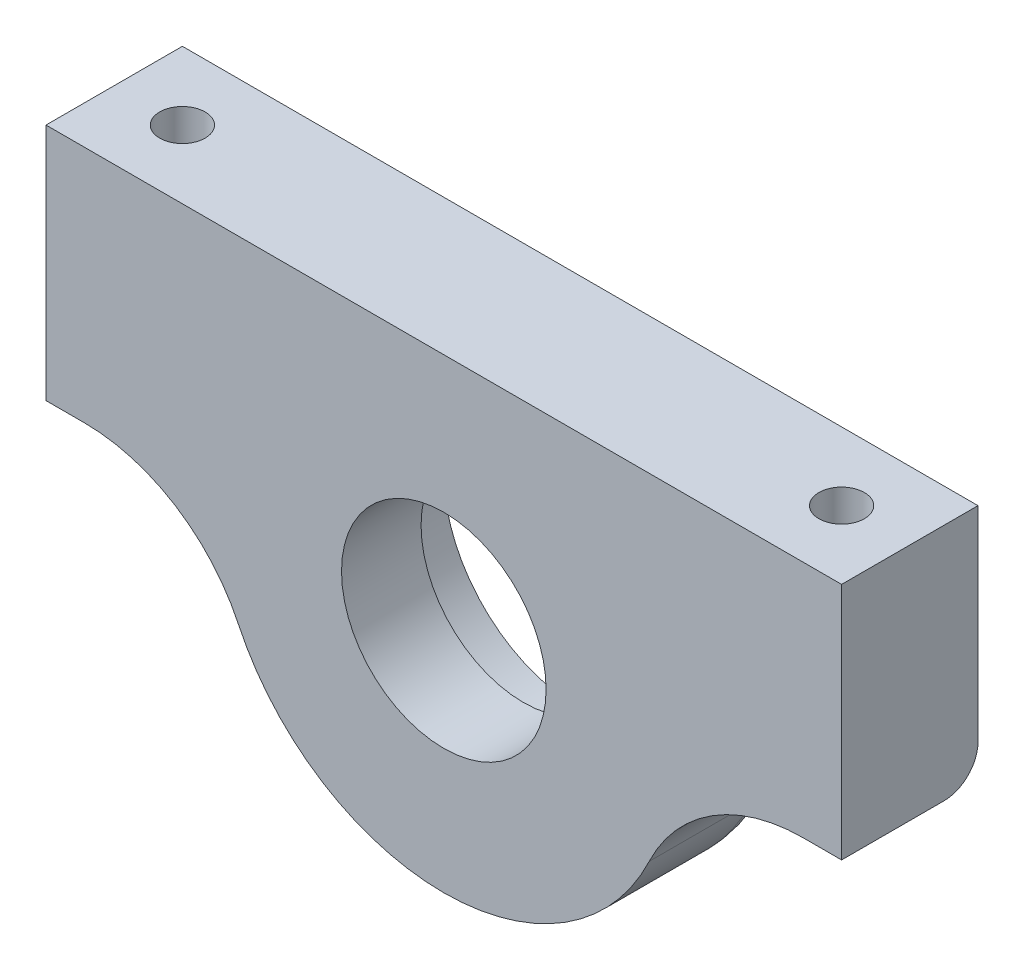
ISO-10303-21;
HEADER;
FILE_DESCRIPTION(('STEP AP214'),'2;1');
FILE_NAME('part.step','',(''),(''),'','','');
FILE_SCHEMA(('AUTOMOTIVE_DESIGN { 1 0 10303 214 1 1 1 1 }'));
ENDSEC;
DATA;
#1=APPLICATION_CONTEXT('core data for automotive mechanical design processes');
#2=APPLICATION_PROTOCOL_DEFINITION('international standard','automotive_design',2000,#1);
#3=PRODUCT_CONTEXT('',#1,'mechanical');
#4=PRODUCT('Part','Part','',(#3));
#5=PRODUCT_RELATED_PRODUCT_CATEGORY('part','',(#4));
#6=PRODUCT_DEFINITION_FORMATION('','',#4);
#7=PRODUCT_DEFINITION_CONTEXT('part definition',#1,'design');
#8=PRODUCT_DEFINITION('design','',#6,#7);
#9=PRODUCT_DEFINITION_SHAPE('','',#8);
#10=(LENGTH_UNIT() NAMED_UNIT(*) SI_UNIT(.MILLI.,.METRE.));
#11=(NAMED_UNIT(*) PLANE_ANGLE_UNIT() SI_UNIT($,.RADIAN.));
#12=(NAMED_UNIT(*) SI_UNIT($,.STERADIAN.) SOLID_ANGLE_UNIT());
#13=UNCERTAINTY_MEASURE_WITH_UNIT(LENGTH_MEASURE(1.E-05),#10,'distance_accuracy_value','');
#14=(GEOMETRIC_REPRESENTATION_CONTEXT(3) GLOBAL_UNCERTAINTY_ASSIGNED_CONTEXT((#13)) GLOBAL_UNIT_ASSIGNED_CONTEXT((#10,
#11,#12)) REPRESENTATION_CONTEXT('',''));
#15=CARTESIAN_POINT('',(0.,0.,0.));
#16=DIRECTION('',(0.,0.,1.));
#17=DIRECTION('',(1.,0.,0.));
#18=AXIS2_PLACEMENT_3D('',#15,#16,#17);
#19=CARTESIAN_POINT('',(0.,0.,6.));
#20=DIRECTION('',(0.,0.,-1.));
#21=DIRECTION('',(-1.,0.,0.));
#22=AXIS2_PLACEMENT_3D('',#19,#20,#21);
#23=CYLINDRICAL_SURFACE('',#22,9.);
#24=CARTESIAN_POINT('',(0.,0.,6.));
#25=DIRECTION('',(0.,0.,1.));
#26=DIRECTION('',(1.,0.,0.));
#27=AXIS2_PLACEMENT_3D('',#24,#25,#26);
#28=CIRCLE('',#27,9.);
#29=CARTESIAN_POINT('',(9.,0.,6.));
#30=VERTEX_POINT('',#29);
#31=EDGE_CURVE('E159',#30,#30,#28,.T.);
#32=ORIENTED_EDGE('',*,*,#31,.T.);
#33=EDGE_LOOP('',(#32));
#34=FACE_BOUND('',#33,.T.);
#35=CARTESIAN_POINT('',(0.,0.,-1.));
#36=DIRECTION('',(0.,0.,-1.));
#37=DIRECTION('',(-1.,0.,0.));
#38=AXIS2_PLACEMENT_3D('',#35,#36,#37);
#39=CIRCLE('',#38,9.);
#40=CARTESIAN_POINT('',(-9.,0.,-1.));
#41=VERTEX_POINT('',#40);
#42=EDGE_CURVE('E157',#41,#41,#39,.T.);
#43=ORIENTED_EDGE('',*,*,#42,.T.);
#44=EDGE_LOOP('',(#43));
#45=FACE_BOUND('',#44,.T.);
#46=ADVANCED_FACE('F36',(#34,#45),#23,.F.);
#47=CARTESIAN_POINT('',(-31.6227766016838,-15.,6.));
#48=DIRECTION('',(0.,0.,1.));
#49=DIRECTION('',(1.,0.,0.));
#50=AXIS2_PLACEMENT_3D('',#47,#48,#49);
#51=PLANE('',#50);
#52=DIRECTION('',(0.,-1.,0.));
#53=VECTOR('',#52,1.);
#54=CARTESIAN_POINT('',(-35.,21.,6.));
#55=LINE('',#54,#53);
#56=CARTESIAN_POINT('',(-35.,21.,6.));
#57=VERTEX_POINT('',#56);
#58=CARTESIAN_POINT('',(-35.,0.,6.));
#59=VERTEX_POINT('',#58);
#60=EDGE_CURVE('E133',#57,#59,#55,.T.);
#61=ORIENTED_EDGE('',*,*,#60,.T.);
#62=DIRECTION('',(1.,0.,0.));
#63=VECTOR('',#62,1.);
#64=CARTESIAN_POINT('',(-35.,0.,6.));
#65=LINE('',#64,#63);
#66=CARTESIAN_POINT('',(-31.6227766016838,0.,6.));
#67=VERTEX_POINT('',#66);
#68=EDGE_CURVE('E121',#59,#67,#65,.T.);
#69=ORIENTED_EDGE('',*,*,#68,.T.);
#70=CARTESIAN_POINT('',(-31.6227766016838,-15.,6.));
#71=DIRECTION('',(0.,0.,-1.));
#72=DIRECTION('',(1.,0.,0.));
#73=AXIS2_PLACEMENT_3D('',#70,#71,#72);
#74=CIRCLE('',#73,15.);
#75=CARTESIAN_POINT('',(-18.070158058105,-8.57142857142856,6.));
#76=VERTEX_POINT('',#75);
#77=EDGE_CURVE('E132',#67,#76,#74,.T.);
#78=ORIENTED_EDGE('',*,*,#77,.T.);
#79=CARTESIAN_POINT('',(0.,0.,6.));
#80=DIRECTION('',(0.,0.,1.));
#81=DIRECTION('',(1.,0.,0.));
#82=AXIS2_PLACEMENT_3D('',#79,#80,#81);
#83=CIRCLE('',#82,20.);
#84=CARTESIAN_POINT('',(18.070158058105,-8.57142857142857,6.));
#85=VERTEX_POINT('',#84);
#86=EDGE_CURVE('E213',#76,#85,#83,.T.);
#87=ORIENTED_EDGE('',*,*,#86,.T.);
#88=CARTESIAN_POINT('',(31.6227766016838,-15.,6.));
#89=DIRECTION('',(0.,0.,-1.));
#90=DIRECTION('',(-1.,0.,0.));
#91=AXIS2_PLACEMENT_3D('',#88,#89,#90);
#92=CIRCLE('',#91,15.);
#93=CARTESIAN_POINT('',(31.6227766016838,0.,6.));
#94=VERTEX_POINT('',#93);
#95=EDGE_CURVE('E215',#85,#94,#92,.T.);
#96=ORIENTED_EDGE('',*,*,#95,.T.);
#97=DIRECTION('',(1.,0.,0.));
#98=VECTOR('',#97,1.);
#99=CARTESIAN_POINT('',(31.6227766016838,0.,6.));
#100=LINE('',#99,#98);
#101=CARTESIAN_POINT('',(35.,0.,6.));
#102=VERTEX_POINT('',#101);
#103=EDGE_CURVE('E217',#94,#102,#100,.T.);
#104=ORIENTED_EDGE('',*,*,#103,.T.);
#105=DIRECTION('',(0.,1.,0.));
#106=VECTOR('',#105,1.);
#107=CARTESIAN_POINT('',(35.,0.,6.));
#108=LINE('',#107,#106);
#109=CARTESIAN_POINT('',(35.,21.,6.));
#110=VERTEX_POINT('',#109);
#111=EDGE_CURVE('E219',#102,#110,#108,.T.);
#112=ORIENTED_EDGE('',*,*,#111,.T.);
#113=DIRECTION('',(-1.,0.,0.));
#114=VECTOR('',#113,1.);
#115=CARTESIAN_POINT('',(-35.,21.,6.));
#116=LINE('',#115,#114);
#117=EDGE_CURVE('E139',#110,#57,#116,.T.);
#118=ORIENTED_EDGE('',*,*,#117,.T.);
#119=EDGE_LOOP('',(#61,#69,#78,#87,#96,#104,#112,#118));
#120=FACE_BOUND('',#119,.T.);
#121=ORIENTED_EDGE('',*,*,#31,.F.);
#122=EDGE_LOOP('',(#121));
#123=FACE_BOUND('',#122,.T.);
#124=ADVANCED_FACE('F136',(#120,#123),#51,.T.);
#125=CARTESIAN_POINT('',(-31.6227766016838,-15.,-6.));
#126=DIRECTION('',(0.,0.,1.));
#127=DIRECTION('',(1.,0.,0.));
#128=AXIS2_PLACEMENT_3D('',#125,#126,#127);
#129=PLANE('',#128);
#130=CARTESIAN_POINT('',(0.,0.,-6.));
#131=DIRECTION('',(0.,0.,-1.));
#132=DIRECTION('',(-1.,0.,0.));
#133=AXIS2_PLACEMENT_3D('',#130,#131,#132);
#134=CIRCLE('',#133,12.);
#135=CARTESIAN_POINT('',(-12.,0.,-6.));
#136=VERTEX_POINT('',#135);
#137=EDGE_CURVE('E205',#136,#136,#134,.T.);
#138=ORIENTED_EDGE('',*,*,#137,.F.);
#139=EDGE_LOOP('',(#138));
#140=FACE_BOUND('',#139,.T.);
#141=CARTESIAN_POINT('',(-31.6227766016838,-15.,-6.));
#142=DIRECTION('',(0.,0.,1.));
#143=DIRECTION('',(1.,0.,0.));
#144=AXIS2_PLACEMENT_3D('',#141,#142,#143);
#145=CIRCLE('',#144,18.);
#146=CARTESIAN_POINT('',(-15.3596343493893,-7.28571428571428,-6.));
#147=VERTEX_POINT('',#146);
#148=CARTESIAN_POINT('',(-31.6227766016838,3.,-6.));
#149=VERTEX_POINT('',#148);
#150=EDGE_CURVE('E167',#147,#149,#145,.T.);
#151=ORIENTED_EDGE('',*,*,#150,.T.);
#152=DIRECTION('',(1.,0.,0.));
#153=VECTOR('',#152,1.);
#154=CARTESIAN_POINT('',(-31.6227766016838,3.,-6.));
#155=LINE('',#154,#153);
#156=CARTESIAN_POINT('',(-35.,3.00000000000001,-6.));
#157=VERTEX_POINT('',#156);
#158=EDGE_CURVE('E169',#149,#157,#155,.F.);
#159=ORIENTED_EDGE('',*,*,#158,.T.);
#160=DIRECTION('',(0.,-1.,0.));
#161=VECTOR('',#160,1.);
#162=CARTESIAN_POINT('',(-35.,21.,-6.));
#163=LINE('',#162,#161);
#164=CARTESIAN_POINT('',(-35.,21.,-6.));
#165=VERTEX_POINT('',#164);
#166=EDGE_CURVE('E210',#165,#157,#163,.T.);
#167=ORIENTED_EDGE('',*,*,#166,.F.);
#168=DIRECTION('',(-1.,0.,0.));
#169=VECTOR('',#168,1.);
#170=CARTESIAN_POINT('',(-35.,21.,-6.));
#171=LINE('',#170,#169);
#172=CARTESIAN_POINT('',(35.,21.,-6.));
#173=VERTEX_POINT('',#172);
#174=EDGE_CURVE('E143',#173,#165,#171,.T.);
#175=ORIENTED_EDGE('',*,*,#174,.F.);
#176=DIRECTION('',(0.,1.,0.));
#177=VECTOR('',#176,1.);
#178=CARTESIAN_POINT('',(35.,0.,-6.));
#179=LINE('',#178,#177);
#180=CARTESIAN_POINT('',(35.,3.,-6.));
#181=VERTEX_POINT('',#180);
#182=EDGE_CURVE('E224',#181,#173,#179,.T.);
#183=ORIENTED_EDGE('',*,*,#182,.F.);
#184=DIRECTION('',(1.,0.,0.));
#185=VECTOR('',#184,1.);
#186=CARTESIAN_POINT('',(-31.6227766016838,3.,-6.));
#187=LINE('',#186,#185);
#188=CARTESIAN_POINT('',(31.6227766016838,3.,-6.));
#189=VERTEX_POINT('',#188);
#190=EDGE_CURVE('E165',#181,#189,#187,.F.);
#191=ORIENTED_EDGE('',*,*,#190,.T.);
#192=CARTESIAN_POINT('',(31.6227766016838,-15.,-6.));
#193=DIRECTION('',(0.,0.,1.));
#194=DIRECTION('',(1.,0.,0.));
#195=AXIS2_PLACEMENT_3D('',#192,#193,#194);
#196=CIRCLE('',#195,18.);
#197=CARTESIAN_POINT('',(15.3596343493893,-7.28571428571429,-6.));
#198=VERTEX_POINT('',#197);
#199=EDGE_CURVE('E163',#189,#198,#196,.T.);
#200=ORIENTED_EDGE('',*,*,#199,.T.);
#201=CARTESIAN_POINT('',(0.,0.,-6.));
#202=DIRECTION('',(0.,0.,1.));
#203=DIRECTION('',(1.,0.,0.));
#204=AXIS2_PLACEMENT_3D('',#201,#202,#203);
#205=CIRCLE('',#204,17.);
#206=EDGE_CURVE('E151',#198,#147,#205,.F.);
#207=ORIENTED_EDGE('',*,*,#206,.T.);
#208=EDGE_LOOP('',(#151,#159,#167,#175,#183,#191,#200,#207));
#209=FACE_BOUND('',#208,.T.);
#210=ADVANCED_FACE('F250',(#140,#209),#129,.F.);
#211=CARTESIAN_POINT('',(-35.,21.,6.));
#212=DIRECTION('',(1.,0.,0.));
#213=DIRECTION('',(0.,0.,-1.));
#214=AXIS2_PLACEMENT_3D('',#211,#212,#213);
#215=PLANE('',#214);
#216=ORIENTED_EDGE('',*,*,#166,.T.);
#217=CARTESIAN_POINT('',(-35.,3.,-3.));
#218=DIRECTION('',(1.,0.,0.));
#219=DIRECTION('',(0.,0.,-1.));
#220=AXIS2_PLACEMENT_3D('',#217,#218,#219);
#221=CIRCLE('',#220,3.);
#222=CARTESIAN_POINT('',(-35.,0.,-3.));
#223=VERTEX_POINT('',#222);
#224=EDGE_CURVE('E148',#157,#223,#221,.F.);
#225=ORIENTED_EDGE('',*,*,#224,.T.);
#226=DIRECTION('',(0.,0.,-1.));
#227=VECTOR('',#226,1.);
#228=CARTESIAN_POINT('',(-35.,0.,6.));
#229=LINE('',#228,#227);
#230=EDGE_CURVE('E126',#59,#223,#229,.T.);
#231=ORIENTED_EDGE('',*,*,#230,.F.);
#232=ORIENTED_EDGE('',*,*,#60,.F.);
#233=DIRECTION('',(0.,0.,-1.));
#234=VECTOR('',#233,1.);
#235=CARTESIAN_POINT('',(-35.,21.,6.));
#236=LINE('',#235,#234);
#237=EDGE_CURVE('E222',#57,#165,#236,.T.);
#238=ORIENTED_EDGE('',*,*,#237,.T.);
#239=EDGE_LOOP('',(#216,#225,#231,#232,#238));
#240=FACE_BOUND('',#239,.T.);
#241=ADVANCED_FACE('F146',(#240),#215,.F.);
#242=CARTESIAN_POINT('',(-35.,0.,6.));
#243=DIRECTION('',(0.,1.,0.));
#244=DIRECTION('',(0.,0.,1.));
#245=AXIS2_PLACEMENT_3D('',#242,#243,#244);
#246=PLANE('',#245);
#247=ORIENTED_EDGE('',*,*,#230,.T.);
#248=DIRECTION('',(1.,0.,0.));
#249=VECTOR('',#248,1.);
#250=CARTESIAN_POINT('',(-35.,0.,-3.));
#251=LINE('',#250,#249);
#252=CARTESIAN_POINT('',(-31.6227766016838,0.,-3.));
#253=VERTEX_POINT('',#252);
#254=EDGE_CURVE('E149',#223,#253,#251,.T.);
#255=ORIENTED_EDGE('',*,*,#254,.T.);
#256=DIRECTION('',(0.,0.,-1.));
#257=VECTOR('',#256,1.);
#258=CARTESIAN_POINT('',(-31.6227766016838,0.,6.));
#259=LINE('',#258,#257);
#260=EDGE_CURVE('E129',#67,#253,#259,.T.);
#261=ORIENTED_EDGE('',*,*,#260,.F.);
#262=ORIENTED_EDGE('',*,*,#68,.F.);
#263=EDGE_LOOP('',(#247,#255,#261,#262));
#264=FACE_BOUND('',#263,.T.);
#265=ADVANCED_FACE('F123',(#264),#246,.F.);
#266=CARTESIAN_POINT('',(-31.6227766016838,-15.,6.));
#267=DIRECTION('',(0.,0.,-1.));
#268=DIRECTION('',(-1.,0.,0.));
#269=AXIS2_PLACEMENT_3D('',#266,#267,#268);
#270=CYLINDRICAL_SURFACE('',#269,15.);
#271=ORIENTED_EDGE('',*,*,#260,.T.);
#272=CARTESIAN_POINT('',(-31.6227766016838,-15.,-3.));
#273=DIRECTION('',(0.,0.,1.));
#274=DIRECTION('',(1.,0.,0.));
#275=AXIS2_PLACEMENT_3D('',#272,#273,#274);
#276=CIRCLE('',#275,15.);
#277=CARTESIAN_POINT('',(-18.070158058105,-8.57142857142856,-3.));
#278=VERTEX_POINT('',#277);
#279=EDGE_CURVE('E172',#253,#278,#276,.F.);
#280=ORIENTED_EDGE('',*,*,#279,.T.);
#281=DIRECTION('',(0.,0.,-1.));
#282=VECTOR('',#281,1.);
#283=CARTESIAN_POINT('',(-18.070158058105,-8.57142857142856,6.));
#284=LINE('',#283,#282);
#285=EDGE_CURVE('E153',#76,#278,#284,.T.);
#286=ORIENTED_EDGE('',*,*,#285,.F.);
#287=ORIENTED_EDGE('',*,*,#77,.F.);
#288=EDGE_LOOP('',(#271,#280,#286,#287));
#289=FACE_BOUND('',#288,.T.);
#290=ADVANCED_FACE('F254',(#289),#270,.F.);
#291=CARTESIAN_POINT('',(0.,0.,6.));
#292=DIRECTION('',(0.,0.,-1.));
#293=DIRECTION('',(-1.,0.,0.));
#294=AXIS2_PLACEMENT_3D('',#291,#292,#293);
#295=CYLINDRICAL_SURFACE('',#294,20.);
#296=ORIENTED_EDGE('',*,*,#285,.T.);
#297=CARTESIAN_POINT('',(0.,0.,-3.));
#298=DIRECTION('',(0.,0.,1.));
#299=DIRECTION('',(1.,0.,0.));
#300=AXIS2_PLACEMENT_3D('',#297,#298,#299);
#301=CIRCLE('',#300,20.);
#302=CARTESIAN_POINT('',(18.070158058105,-8.57142857142857,-3.));
#303=VERTEX_POINT('',#302);
#304=EDGE_CURVE('E11',#278,#303,#301,.T.);
#305=ORIENTED_EDGE('',*,*,#304,.T.);
#306=DIRECTION('',(0.,0.,-1.));
#307=VECTOR('',#306,1.);
#308=CARTESIAN_POINT('',(18.070158058105,-8.57142857142857,6.));
#309=LINE('',#308,#307);
#310=EDGE_CURVE('E236',#85,#303,#309,.T.);
#311=ORIENTED_EDGE('',*,*,#310,.F.);
#312=ORIENTED_EDGE('',*,*,#86,.F.);
#313=EDGE_LOOP('',(#296,#305,#311,#312));
#314=FACE_BOUND('',#313,.T.);
#315=ADVANCED_FACE('F239',(#314),#295,.T.);
#316=CARTESIAN_POINT('',(31.6227766016838,-15.,6.));
#317=DIRECTION('',(0.,0.,-1.));
#318=DIRECTION('',(-1.,0.,0.));
#319=AXIS2_PLACEMENT_3D('',#316,#317,#318);
#320=CYLINDRICAL_SURFACE('',#319,15.);
#321=ORIENTED_EDGE('',*,*,#310,.T.);
#322=CARTESIAN_POINT('',(31.6227766016838,-15.,-3.));
#323=DIRECTION('',(0.,0.,1.));
#324=DIRECTION('',(1.,0.,0.));
#325=AXIS2_PLACEMENT_3D('',#322,#323,#324);
#326=CIRCLE('',#325,15.);
#327=CARTESIAN_POINT('',(31.6227766016838,0.,-3.));
#328=VERTEX_POINT('',#327);
#329=EDGE_CURVE('E45',#303,#328,#326,.F.);
#330=ORIENTED_EDGE('',*,*,#329,.T.);
#331=DIRECTION('',(0.,0.,-1.));
#332=VECTOR('',#331,1.);
#333=CARTESIAN_POINT('',(31.6227766016838,0.,6.));
#334=LINE('',#333,#332);
#335=EDGE_CURVE('E234',#94,#328,#334,.T.);
#336=ORIENTED_EDGE('',*,*,#335,.F.);
#337=ORIENTED_EDGE('',*,*,#95,.F.);
#338=EDGE_LOOP('',(#321,#330,#336,#337));
#339=FACE_BOUND('',#338,.T.);
#340=ADVANCED_FACE('F256',(#339),#320,.F.);
#341=CARTESIAN_POINT('',(31.6227766016838,0.,6.));
#342=DIRECTION('',(0.,1.,0.));
#343=DIRECTION('',(0.,0.,1.));
#344=AXIS2_PLACEMENT_3D('',#341,#342,#343);
#345=PLANE('',#344);
#346=ORIENTED_EDGE('',*,*,#335,.T.);
#347=DIRECTION('',(1.,0.,0.));
#348=VECTOR('',#347,1.);
#349=CARTESIAN_POINT('',(31.6227766016838,0.,-3.));
#350=LINE('',#349,#348);
#351=CARTESIAN_POINT('',(35.,0.,-3.));
#352=VERTEX_POINT('',#351);
#353=EDGE_CURVE('E174',#328,#352,#350,.T.);
#354=ORIENTED_EDGE('',*,*,#353,.T.);
#355=DIRECTION('',(0.,0.,-1.));
#356=VECTOR('',#355,1.);
#357=CARTESIAN_POINT('',(35.,0.,6.));
#358=LINE('',#357,#356);
#359=EDGE_CURVE('E231',#102,#352,#358,.T.);
#360=ORIENTED_EDGE('',*,*,#359,.F.);
#361=ORIENTED_EDGE('',*,*,#103,.F.);
#362=EDGE_LOOP('',(#346,#354,#360,#361));
#363=FACE_BOUND('',#362,.T.);
#364=ADVANCED_FACE('F261',(#363),#345,.F.);
#365=CARTESIAN_POINT('',(35.,0.,6.));
#366=DIRECTION('',(-1.,0.,0.));
#367=DIRECTION('',(0.,0.,1.));
#368=AXIS2_PLACEMENT_3D('',#365,#366,#367);
#369=PLANE('',#368);
#370=ORIENTED_EDGE('',*,*,#359,.T.);
#371=CARTESIAN_POINT('',(35.,3.,-3.));
#372=DIRECTION('',(-1.,0.,0.));
#373=DIRECTION('',(0.,0.,1.));
#374=AXIS2_PLACEMENT_3D('',#371,#372,#373);
#375=CIRCLE('',#374,3.);
#376=EDGE_CURVE('E176',#352,#181,#375,.F.);
#377=ORIENTED_EDGE('',*,*,#376,.T.);
#378=ORIENTED_EDGE('',*,*,#182,.T.);
#379=DIRECTION('',(0.,0.,-1.));
#380=VECTOR('',#379,1.);
#381=CARTESIAN_POINT('',(35.,21.,6.));
#382=LINE('',#381,#380);
#383=EDGE_CURVE('E228',#110,#173,#382,.T.);
#384=ORIENTED_EDGE('',*,*,#383,.F.);
#385=ORIENTED_EDGE('',*,*,#111,.F.);
#386=EDGE_LOOP('',(#370,#377,#378,#384,#385));
#387=FACE_BOUND('',#386,.T.);
#388=ADVANCED_FACE('F265',(#387),#369,.F.);
#389=CARTESIAN_POINT('',(-35.,21.,6.));
#390=DIRECTION('',(0.,-1.,0.));
#391=DIRECTION('',(0.,0.,-1.));
#392=AXIS2_PLACEMENT_3D('',#389,#390,#391);
#393=PLANE('',#392);
#394=CARTESIAN_POINT('',(-29.,21.,0.));
#395=DIRECTION('',(0.,1.,0.));
#396=DIRECTION('',(0.,0.,1.));
#397=AXIS2_PLACEMENT_3D('',#394,#395,#396);
#398=CIRCLE('',#397,2.);
#399=CARTESIAN_POINT('',(-29.,21.,2.));
#400=VERTEX_POINT('',#399);
#401=EDGE_CURVE('E199',#400,#400,#398,.T.);
#402=ORIENTED_EDGE('',*,*,#401,.F.);
#403=EDGE_LOOP('',(#402));
#404=FACE_BOUND('',#403,.T.);
#405=CARTESIAN_POINT('',(29.,21.,0.));
#406=DIRECTION('',(0.,1.,0.));
#407=DIRECTION('',(0.,0.,1.));
#408=AXIS2_PLACEMENT_3D('',#405,#406,#407);
#409=CIRCLE('',#408,2.);
#410=CARTESIAN_POINT('',(29.,21.,1.99999999999999));
#411=VERTEX_POINT('',#410);
#412=EDGE_CURVE('E189',#411,#411,#409,.T.);
#413=ORIENTED_EDGE('',*,*,#412,.F.);
#414=EDGE_LOOP('',(#413));
#415=FACE_BOUND('',#414,.T.);
#416=ORIENTED_EDGE('',*,*,#174,.T.);
#417=ORIENTED_EDGE('',*,*,#237,.F.);
#418=ORIENTED_EDGE('',*,*,#117,.F.);
#419=ORIENTED_EDGE('',*,*,#383,.T.);
#420=EDGE_LOOP('',(#416,#417,#418,#419));
#421=FACE_BOUND('',#420,.T.);
#422=ADVANCED_FACE('F269',(#404,#415,#421),#393,.F.);
#423=CARTESIAN_POINT('',(0.,0.,-1.));
#424=DIRECTION('',(0.,0.,-1.));
#425=DIRECTION('',(-1.,0.,0.));
#426=AXIS2_PLACEMENT_3D('',#423,#424,#425);
#427=CYLINDRICAL_SURFACE('',#426,12.);
#428=CARTESIAN_POINT('',(0.,0.,-1.));
#429=DIRECTION('',(0.,0.,-1.));
#430=DIRECTION('',(-1.,0.,0.));
#431=AXIS2_PLACEMENT_3D('',#428,#429,#430);
#432=CIRCLE('',#431,12.);
#433=CARTESIAN_POINT('',(-12.,0.,-1.));
#434=VERTEX_POINT('',#433);
#435=EDGE_CURVE('E160',#434,#434,#432,.T.);
#436=ORIENTED_EDGE('',*,*,#435,.F.);
#437=EDGE_LOOP('',(#436));
#438=FACE_BOUND('',#437,.T.);
#439=ORIENTED_EDGE('',*,*,#137,.T.);
#440=EDGE_LOOP('',(#439));
#441=FACE_BOUND('',#440,.T.);
#442=ADVANCED_FACE('F290',(#438,#441),#427,.F.);
#443=CARTESIAN_POINT('',(0.,0.,-1.));
#444=DIRECTION('',(0.,0.,-1.));
#445=DIRECTION('',(-1.,0.,0.));
#446=AXIS2_PLACEMENT_3D('',#443,#444,#445);
#447=PLANE('',#446);
#448=ORIENTED_EDGE('',*,*,#42,.F.);
#449=EDGE_LOOP('',(#448));
#450=FACE_BOUND('',#449,.T.);
#451=ORIENTED_EDGE('',*,*,#435,.T.);
#452=EDGE_LOOP('',(#451));
#453=FACE_BOUND('',#452,.T.);
#454=ADVANCED_FACE('F378',(#450,#453),#447,.T.);
#455=CARTESIAN_POINT('',(29.,11.,0.));
#456=DIRECTION('',(0.,1.,0.));
#457=DIRECTION('',(0.,0.,1.));
#458=AXIS2_PLACEMENT_3D('',#455,#456,#457);
#459=CYLINDRICAL_SURFACE('',#458,2.);
#460=CARTESIAN_POINT('',(29.,11.,0.));
#461=DIRECTION('',(0.,1.,0.));
#462=DIRECTION('',(0.,0.,1.));
#463=AXIS2_PLACEMENT_3D('',#460,#461,#462);
#464=CIRCLE('',#463,2.);
#465=CARTESIAN_POINT('',(29.,11.,1.99999999999999));
#466=VERTEX_POINT('',#465);
#467=EDGE_CURVE('E194',#466,#466,#464,.T.);
#468=ORIENTED_EDGE('',*,*,#467,.F.);
#469=EDGE_LOOP('',(#468));
#470=FACE_BOUND('',#469,.T.);
#471=ORIENTED_EDGE('',*,*,#412,.T.);
#472=EDGE_LOOP('',(#471));
#473=FACE_BOUND('',#472,.T.);
#474=ADVANCED_FACE('F369',(#470,#473),#459,.F.);
#475=CARTESIAN_POINT('',(29.,11.,0.));
#476=DIRECTION('',(0.,1.,0.));
#477=DIRECTION('',(0.,0.,1.));
#478=AXIS2_PLACEMENT_3D('',#475,#476,#477);
#479=PLANE('',#478);
#480=ORIENTED_EDGE('',*,*,#467,.T.);
#481=EDGE_LOOP('',(#480));
#482=FACE_BOUND('',#481,.T.);
#483=ADVANCED_FACE('F360',(#482),#479,.T.);
#484=CARTESIAN_POINT('',(-29.,11.,0.));
#485=DIRECTION('',(0.,1.,0.));
#486=DIRECTION('',(0.,0.,1.));
#487=AXIS2_PLACEMENT_3D('',#484,#485,#486);
#488=CYLINDRICAL_SURFACE('',#487,2.);
#489=CARTESIAN_POINT('',(-29.,11.,0.));
#490=DIRECTION('',(0.,1.,0.));
#491=DIRECTION('',(0.,0.,1.));
#492=AXIS2_PLACEMENT_3D('',#489,#490,#491);
#493=CIRCLE('',#492,2.);
#494=CARTESIAN_POINT('',(-29.,11.,2.));
#495=VERTEX_POINT('',#494);
#496=EDGE_CURVE('E208',#495,#495,#493,.T.);
#497=ORIENTED_EDGE('',*,*,#496,.F.);
#498=EDGE_LOOP('',(#497));
#499=FACE_BOUND('',#498,.T.);
#500=ORIENTED_EDGE('',*,*,#401,.T.);
#501=EDGE_LOOP('',(#500));
#502=FACE_BOUND('',#501,.T.);
#503=ADVANCED_FACE('F350',(#499,#502),#488,.F.);
#504=CARTESIAN_POINT('',(-29.,11.,0.));
#505=DIRECTION('',(0.,1.,0.));
#506=DIRECTION('',(0.,0.,1.));
#507=AXIS2_PLACEMENT_3D('',#504,#505,#506);
#508=PLANE('',#507);
#509=ORIENTED_EDGE('',*,*,#496,.T.);
#510=EDGE_LOOP('',(#509));
#511=FACE_BOUND('',#510,.T.);
#512=ADVANCED_FACE('F280',(#511),#508,.T.);
#513=CARTESIAN_POINT('',(31.6227766016838,3.,-3.));
#514=DIRECTION('',(1.,0.,0.));
#515=DIRECTION('',(0.,0.,-1.));
#516=AXIS2_PLACEMENT_3D('',#513,#514,#515);
#517=CYLINDRICAL_SURFACE('',#516,3.);
#518=ORIENTED_EDGE('',*,*,#376,.F.);
#519=ORIENTED_EDGE('',*,*,#353,.F.);
#520=CARTESIAN_POINT('',(31.6227766016838,3.,-3.));
#521=DIRECTION('',(-1.,0.,0.));
#522=DIRECTION('',(0.,0.,1.));
#523=AXIS2_PLACEMENT_3D('',#520,#521,#522);
#524=CIRCLE('',#523,3.);
#525=EDGE_CURVE('E40',#189,#328,#524,.T.);
#526=ORIENTED_EDGE('',*,*,#525,.F.);
#527=ORIENTED_EDGE('',*,*,#190,.F.);
#528=EDGE_LOOP('',(#518,#519,#526,#527));
#529=FACE_BOUND('',#528,.T.);
#530=ADVANCED_FACE('F38',(#529),#517,.T.);
#531=CARTESIAN_POINT('',(31.6227766016838,-15.,-3.));
#532=DIRECTION('',(0.,0.,1.));
#533=DIRECTION('',(1.,0.,0.));
#534=AXIS2_PLACEMENT_3D('',#531,#532,#533);
#535=TOROIDAL_SURFACE('',#534,18.,3.);
#536=ORIENTED_EDGE('',*,*,#525,.T.);
#537=ORIENTED_EDGE('',*,*,#329,.F.);
#538=CARTESIAN_POINT('',(15.3596343493893,-7.28571428571429,-3.));
#539=DIRECTION('',(-0.428571428571429,-0.903507902905251,0.));
#540=DIRECTION('',(0.903507902905251,-0.428571428571429,0.));
#541=AXIS2_PLACEMENT_3D('',#538,#539,#540);
#542=CIRCLE('',#541,3.);
#543=EDGE_CURVE('E183',#198,#303,#542,.T.);
#544=ORIENTED_EDGE('',*,*,#543,.F.);
#545=ORIENTED_EDGE('',*,*,#199,.F.);
#546=EDGE_LOOP('',(#536,#537,#544,#545));
#547=FACE_BOUND('',#546,.T.);
#548=ADVANCED_FACE('F273',(#547),#535,.T.);
#549=CARTESIAN_POINT('',(0.,0.,-3.));
#550=DIRECTION('',(0.,0.,1.));
#551=DIRECTION('',(1.,0.,0.));
#552=AXIS2_PLACEMENT_3D('',#549,#550,#551);
#553=TOROIDAL_SURFACE('',#552,17.,3.);
#554=ORIENTED_EDGE('',*,*,#543,.T.);
#555=ORIENTED_EDGE('',*,*,#304,.F.);
#556=CARTESIAN_POINT('',(-15.3596343493893,-7.28571428571428,-3.));
#557=DIRECTION('',(-0.428571428571429,0.903507902905251,0.));
#558=DIRECTION('',(-0.903507902905251,-0.428571428571429,0.));
#559=AXIS2_PLACEMENT_3D('',#556,#557,#558);
#560=CIRCLE('',#559,3.);
#561=EDGE_CURVE('E181',#147,#278,#560,.T.);
#562=ORIENTED_EDGE('',*,*,#561,.F.);
#563=ORIENTED_EDGE('',*,*,#206,.F.);
#564=EDGE_LOOP('',(#554,#555,#562,#563));
#565=FACE_BOUND('',#564,.T.);
#566=ADVANCED_FACE('F242',(#565),#553,.T.);
#567=CARTESIAN_POINT('',(-31.6227766016838,-15.,-3.));
#568=DIRECTION('',(0.,0.,1.));
#569=DIRECTION('',(1.,0.,0.));
#570=AXIS2_PLACEMENT_3D('',#567,#568,#569);
#571=TOROIDAL_SURFACE('',#570,18.,3.);
#572=ORIENTED_EDGE('',*,*,#561,.T.);
#573=ORIENTED_EDGE('',*,*,#279,.F.);
#574=CARTESIAN_POINT('',(-31.6227766016838,3.,-3.));
#575=DIRECTION('',(-1.,0.,0.));
#576=DIRECTION('',(0.,0.,1.));
#577=AXIS2_PLACEMENT_3D('',#574,#575,#576);
#578=CIRCLE('',#577,3.);
#579=EDGE_CURVE('E179',#149,#253,#578,.T.);
#580=ORIENTED_EDGE('',*,*,#579,.F.);
#581=ORIENTED_EDGE('',*,*,#150,.F.);
#582=EDGE_LOOP('',(#572,#573,#580,#581));
#583=FACE_BOUND('',#582,.T.);
#584=ADVANCED_FACE('F246',(#583),#571,.T.);
#585=CARTESIAN_POINT('',(-35.,3.,-3.));
#586=DIRECTION('',(1.,0.,0.));
#587=DIRECTION('',(0.,0.,-1.));
#588=AXIS2_PLACEMENT_3D('',#585,#586,#587);
#589=CYLINDRICAL_SURFACE('',#588,3.);
#590=ORIENTED_EDGE('',*,*,#224,.F.);
#591=ORIENTED_EDGE('',*,*,#158,.F.);
#592=ORIENTED_EDGE('',*,*,#579,.T.);
#593=ORIENTED_EDGE('',*,*,#254,.F.);
#594=EDGE_LOOP('',(#590,#591,#592,#593));
#595=FACE_BOUND('',#594,.T.);
#596=ADVANCED_FACE('F253',(#595),#589,.T.);
#597=CLOSED_SHELL('',(#46,#124,#210,#241,#265,#290,#315,#340,#364,#388,#422,#442,#454,#474,#483,
#503,#512,#530,#548,#566,#584,#596));
#598=MANIFOLD_SOLID_BREP('B2',#597);
#599=ADVANCED_BREP_SHAPE_REPRESENTATION('',(#18,#598),#14);
#600=SHAPE_DEFINITION_REPRESENTATION(#9,#599);
ENDSEC;
END-ISO-10303-21;
